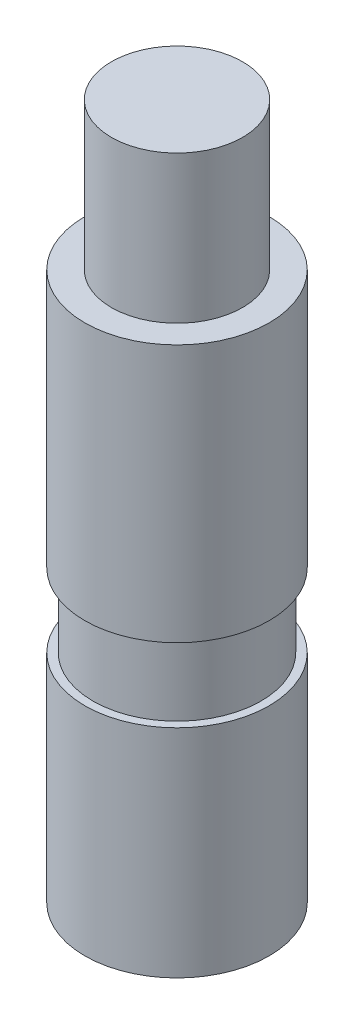
ISO-10303-21;
HEADER;
FILE_DESCRIPTION(('STEP AP214'),'2;1');
FILE_NAME('part.step','',(''),(''),'','','');
FILE_SCHEMA(('AUTOMOTIVE_DESIGN { 1 0 10303 214 1 1 1 1 }'));
ENDSEC;
DATA;
#1=APPLICATION_CONTEXT('core data for automotive mechanical design processes');
#2=APPLICATION_PROTOCOL_DEFINITION('international standard','automotive_design',2000,#1);
#3=PRODUCT_CONTEXT('',#1,'mechanical');
#4=PRODUCT('Part','Part','',(#3));
#5=PRODUCT_RELATED_PRODUCT_CATEGORY('part','',(#4));
#6=PRODUCT_DEFINITION_FORMATION('','',#4);
#7=PRODUCT_DEFINITION_CONTEXT('part definition',#1,'design');
#8=PRODUCT_DEFINITION('design','',#6,#7);
#9=PRODUCT_DEFINITION_SHAPE('','',#8);
#10=(LENGTH_UNIT() NAMED_UNIT(*) SI_UNIT(.MILLI.,.METRE.));
#11=(NAMED_UNIT(*) PLANE_ANGLE_UNIT() SI_UNIT($,.RADIAN.));
#12=(NAMED_UNIT(*) SI_UNIT($,.STERADIAN.) SOLID_ANGLE_UNIT());
#13=UNCERTAINTY_MEASURE_WITH_UNIT(LENGTH_MEASURE(1.E-05),#10,'distance_accuracy_value','');
#14=(GEOMETRIC_REPRESENTATION_CONTEXT(3) GLOBAL_UNCERTAINTY_ASSIGNED_CONTEXT((#13)) GLOBAL_UNIT_ASSIGNED_CONTEXT((#10,
#11,#12)) REPRESENTATION_CONTEXT('',''));
#15=CARTESIAN_POINT('',(0.,0.,0.));
#16=DIRECTION('',(0.,0.,1.));
#17=DIRECTION('',(1.,0.,0.));
#18=AXIS2_PLACEMENT_3D('',#15,#16,#17);
#19=CARTESIAN_POINT('',(0.,119.888,0.));
#20=DIRECTION('',(0.,-1.,0.));
#21=DIRECTION('',(0.,0.,-1.));
#22=AXIS2_PLACEMENT_3D('',#19,#20,#21);
#23=CYLINDRICAL_SURFACE('',#22,15.875);
#24=CARTESIAN_POINT('',(0.,50.038,0.));
#25=DIRECTION('',(0.,1.,0.));
#26=DIRECTION('',(0.,0.,1.));
#27=AXIS2_PLACEMENT_3D('',#24,#25,#26);
#28=CIRCLE('',#27,15.875);
#29=CARTESIAN_POINT('',(0.,50.038,15.875));
#30=VERTEX_POINT('',#29);
#31=EDGE_CURVE('E52',#30,#30,#28,.T.);
#32=ORIENTED_EDGE('',*,*,#31,.T.);
#33=EDGE_LOOP('',(#32));
#34=FACE_BOUND('',#33,.T.);
#35=CARTESIAN_POINT('',(0.,94.488,0.));
#36=DIRECTION('',(0.,1.,0.));
#37=DIRECTION('',(0.,0.,1.));
#38=AXIS2_PLACEMENT_3D('',#35,#36,#37);
#39=CIRCLE('',#38,15.875);
#40=CARTESIAN_POINT('',(0.,94.488,15.875));
#41=VERTEX_POINT('',#40);
#42=EDGE_CURVE('E38',#41,#41,#39,.T.);
#43=ORIENTED_EDGE('',*,*,#42,.F.);
#44=EDGE_LOOP('',(#43));
#45=FACE_BOUND('',#44,.T.);
#46=ADVANCED_FACE('F32',(#34,#45),#23,.T.);
#47=CARTESIAN_POINT('',(0.,94.488,0.));
#48=DIRECTION('',(0.,1.,0.));
#49=DIRECTION('',(0.,0.,1.));
#50=AXIS2_PLACEMENT_3D('',#47,#48,#49);
#51=PLANE('',#50);
#52=CARTESIAN_POINT('',(0.,94.488,0.));
#53=DIRECTION('',(0.,1.,0.));
#54=DIRECTION('',(0.,0.,1.));
#55=AXIS2_PLACEMENT_3D('',#52,#53,#54);
#56=CIRCLE('',#55,11.303);
#57=CARTESIAN_POINT('',(0.,94.488,11.303));
#58=VERTEX_POINT('',#57);
#59=EDGE_CURVE('E42',#58,#58,#56,.T.);
#60=ORIENTED_EDGE('',*,*,#59,.F.);
#61=EDGE_LOOP('',(#60));
#62=FACE_BOUND('',#61,.T.);
#63=ORIENTED_EDGE('',*,*,#42,.T.);
#64=EDGE_LOOP('',(#63));
#65=FACE_BOUND('',#64,.T.);
#66=ADVANCED_FACE('F83',(#62,#65),#51,.T.);
#67=CARTESIAN_POINT('',(0.,94.488,0.));
#68=DIRECTION('',(0.,1.,0.));
#69=DIRECTION('',(0.,0.,1.));
#70=AXIS2_PLACEMENT_3D('',#67,#68,#69);
#71=CYLINDRICAL_SURFACE('',#70,11.303);
#72=ORIENTED_EDGE('',*,*,#59,.T.);
#73=EDGE_LOOP('',(#72));
#74=FACE_BOUND('',#73,.T.);
#75=CARTESIAN_POINT('',(0.,119.888,0.));
#76=DIRECTION('',(0.,1.,0.));
#77=DIRECTION('',(0.,0.,1.));
#78=AXIS2_PLACEMENT_3D('',#75,#76,#77);
#79=CIRCLE('',#78,11.303);
#80=CARTESIAN_POINT('',(0.,119.888,11.303));
#81=VERTEX_POINT('',#80);
#82=EDGE_CURVE('E46',#81,#81,#79,.T.);
#83=ORIENTED_EDGE('',*,*,#82,.F.);
#84=EDGE_LOOP('',(#83));
#85=FACE_BOUND('',#84,.T.);
#86=ADVANCED_FACE('F88',(#74,#85),#71,.T.);
#87=CARTESIAN_POINT('',(0.,119.888,0.));
#88=DIRECTION('',(0.,1.,0.));
#89=DIRECTION('',(0.,0.,1.));
#90=AXIS2_PLACEMENT_3D('',#87,#88,#89);
#91=PLANE('',#90);
#92=ORIENTED_EDGE('',*,*,#82,.T.);
#93=EDGE_LOOP('',(#92));
#94=FACE_BOUND('',#93,.T.);
#95=ADVANCED_FACE('F71',(#94),#91,.T.);
#96=CARTESIAN_POINT('',(0.,37.338,0.));
#97=DIRECTION('',(0.,1.,0.));
#98=DIRECTION('',(0.,0.,1.));
#99=AXIS2_PLACEMENT_3D('',#96,#97,#98);
#100=PLANE('',#99);
#101=CARTESIAN_POINT('',(0.,37.338,0.));
#102=DIRECTION('',(0.,1.,0.));
#103=DIRECTION('',(0.,0.,1.));
#104=AXIS2_PLACEMENT_3D('',#101,#102,#103);
#105=CIRCLE('',#104,14.478);
#106=CARTESIAN_POINT('',(0.,37.338,14.478));
#107=VERTEX_POINT('',#106);
#108=EDGE_CURVE('E55',#107,#107,#105,.T.);
#109=ORIENTED_EDGE('',*,*,#108,.F.);
#110=EDGE_LOOP('',(#109));
#111=FACE_BOUND('',#110,.T.);
#112=CARTESIAN_POINT('',(0.,37.338,0.));
#113=DIRECTION('',(0.,1.,0.));
#114=DIRECTION('',(0.,0.,1.));
#115=AXIS2_PLACEMENT_3D('',#112,#113,#114);
#116=CIRCLE('',#115,15.875);
#117=CARTESIAN_POINT('',(0.,37.338,15.875));
#118=VERTEX_POINT('',#117);
#119=EDGE_CURVE('E50',#118,#118,#116,.T.);
#120=ORIENTED_EDGE('',*,*,#119,.T.);
#121=EDGE_LOOP('',(#120));
#122=FACE_BOUND('',#121,.T.);
#123=ADVANCED_FACE('F67',(#111,#122),#100,.T.);
#124=CARTESIAN_POINT('',(0.,50.038,0.));
#125=DIRECTION('',(0.,1.,0.));
#126=DIRECTION('',(0.,0.,1.));
#127=AXIS2_PLACEMENT_3D('',#124,#125,#126);
#128=PLANE('',#127);
#129=CARTESIAN_POINT('',(0.,50.038,0.));
#130=DIRECTION('',(0.,1.,0.));
#131=DIRECTION('',(0.,0.,1.));
#132=AXIS2_PLACEMENT_3D('',#129,#130,#131);
#133=CIRCLE('',#132,14.478);
#134=CARTESIAN_POINT('',(0.,50.038,14.478));
#135=VERTEX_POINT('',#134);
#136=EDGE_CURVE('E58',#135,#135,#133,.T.);
#137=ORIENTED_EDGE('',*,*,#136,.T.);
#138=EDGE_LOOP('',(#137));
#139=FACE_BOUND('',#138,.T.);
#140=ORIENTED_EDGE('',*,*,#31,.F.);
#141=EDGE_LOOP('',(#140));
#142=FACE_BOUND('',#141,.T.);
#143=ADVANCED_FACE('F70',(#139,#142),#128,.F.);
#144=CARTESIAN_POINT('',(0.,37.338,0.));
#145=DIRECTION('',(0.,1.,0.));
#146=DIRECTION('',(0.,0.,1.));
#147=AXIS2_PLACEMENT_3D('',#144,#145,#146);
#148=CYLINDRICAL_SURFACE('',#147,14.478);
#149=ORIENTED_EDGE('',*,*,#108,.T.);
#150=EDGE_LOOP('',(#149));
#151=FACE_BOUND('',#150,.T.);
#152=ORIENTED_EDGE('',*,*,#136,.F.);
#153=EDGE_LOOP('',(#152));
#154=FACE_BOUND('',#153,.T.);
#155=ADVANCED_FACE('F64',(#151,#154),#148,.T.);
#156=CARTESIAN_POINT('',(0.,0.,0.));
#157=DIRECTION('',(0.,1.,0.));
#158=DIRECTION('',(0.,0.,1.));
#159=AXIS2_PLACEMENT_3D('',#156,#157,#158);
#160=PLANE('',#159);
#161=CARTESIAN_POINT('',(0.,0.,0.));
#162=DIRECTION('',(0.,1.,0.));
#163=DIRECTION('',(0.,0.,1.));
#164=AXIS2_PLACEMENT_3D('',#161,#162,#163);
#165=CIRCLE('',#164,15.875);
#166=CARTESIAN_POINT('',(0.,0.,15.875));
#167=VERTEX_POINT('',#166);
#168=EDGE_CURVE('E10',#167,#167,#165,.T.);
#169=ORIENTED_EDGE('',*,*,#168,.F.);
#170=EDGE_LOOP('',(#169));
#171=FACE_BOUND('',#170,.T.);
#172=ADVANCED_FACE('F77',(#171),#160,.F.);
#173=ORIENTED_EDGE('',*,*,#168,.T.);
#174=EDGE_LOOP('',(#173));
#175=FACE_BOUND('',#174,.T.);
#176=ORIENTED_EDGE('',*,*,#119,.F.);
#177=EDGE_LOOP('',(#176));
#178=FACE_BOUND('',#177,.T.);
#179=ADVANCED_FACE('F75',(#175,#178),#23,.T.);
#180=CLOSED_SHELL('',(#46,#66,#86,#95,#123,#143,#155,#172,#179));
#181=MANIFOLD_SOLID_BREP('B2',#180);
#182=ADVANCED_BREP_SHAPE_REPRESENTATION('',(#18,#181),#14);
#183=SHAPE_DEFINITION_REPRESENTATION(#9,#182);
ENDSEC;
END-ISO-10303-21;
